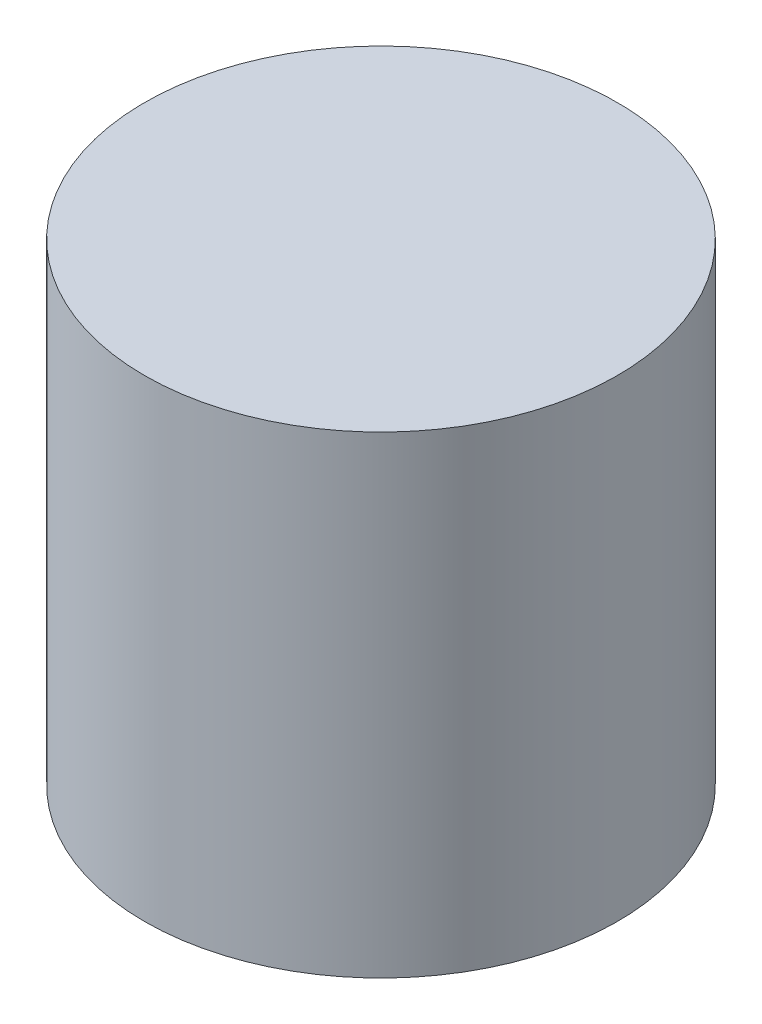
ISO-10303-21;
HEADER;
FILE_DESCRIPTION(('STEP AP214'),'2;1');
FILE_NAME('part.step','',(''),(''),'','','');
FILE_SCHEMA(('AUTOMOTIVE_DESIGN { 1 0 10303 214 1 1 1 1 }'));
ENDSEC;
DATA;
#1=APPLICATION_CONTEXT('core data for automotive mechanical design processes');
#2=APPLICATION_PROTOCOL_DEFINITION('international standard','automotive_design',2000,#1);
#3=PRODUCT_CONTEXT('',#1,'mechanical');
#4=PRODUCT('Part','Part','',(#3));
#5=PRODUCT_RELATED_PRODUCT_CATEGORY('part','',(#4));
#6=PRODUCT_DEFINITION_FORMATION('','',#4);
#7=PRODUCT_DEFINITION_CONTEXT('part definition',#1,'design');
#8=PRODUCT_DEFINITION('design','',#6,#7);
#9=PRODUCT_DEFINITION_SHAPE('','',#8);
#10=(LENGTH_UNIT() NAMED_UNIT(*) SI_UNIT(.MILLI.,.METRE.));
#11=(NAMED_UNIT(*) PLANE_ANGLE_UNIT() SI_UNIT($,.RADIAN.));
#12=(NAMED_UNIT(*) SI_UNIT($,.STERADIAN.) SOLID_ANGLE_UNIT());
#13=UNCERTAINTY_MEASURE_WITH_UNIT(LENGTH_MEASURE(1.E-05),#10,'distance_accuracy_value','');
#14=(GEOMETRIC_REPRESENTATION_CONTEXT(3) GLOBAL_UNCERTAINTY_ASSIGNED_CONTEXT((#13)) GLOBAL_UNIT_ASSIGNED_CONTEXT((#10,
#11,#12)) REPRESENTATION_CONTEXT('',''));
#15=CARTESIAN_POINT('',(0.,0.,0.));
#16=DIRECTION('',(0.,0.,1.));
#17=DIRECTION('',(1.,0.,0.));
#18=AXIS2_PLACEMENT_3D('',#15,#16,#17);
#19=CARTESIAN_POINT('',(0.,6.35,0.));
#20=DIRECTION('',(0.,-1.,0.));
#21=DIRECTION('',(0.,0.,-1.));
#22=AXIS2_PLACEMENT_3D('',#19,#20,#21);
#23=CYLINDRICAL_SURFACE('',#22,3.175);
#24=CARTESIAN_POINT('',(0.,6.35,0.));
#25=DIRECTION('',(0.,1.,0.));
#26=DIRECTION('',(0.,0.,1.));
#27=AXIS2_PLACEMENT_3D('',#24,#25,#26);
#28=CIRCLE('',#27,3.175);
#29=CARTESIAN_POINT('',(0.,6.35,3.175));
#30=VERTEX_POINT('',#29);
#31=EDGE_CURVE('E10',#30,#30,#28,.T.);
#32=ORIENTED_EDGE('',*,*,#31,.F.);
#33=EDGE_LOOP('',(#32));
#34=FACE_BOUND('',#33,.T.);
#35=CARTESIAN_POINT('',(0.,0.,0.));
#36=DIRECTION('',(0.,1.,0.));
#37=DIRECTION('',(0.,0.,1.));
#38=AXIS2_PLACEMENT_3D('',#35,#36,#37);
#39=CIRCLE('',#38,3.175);
#40=CARTESIAN_POINT('',(0.,0.,3.175));
#41=VERTEX_POINT('',#40);
#42=EDGE_CURVE('E34',#41,#41,#39,.T.);
#43=ORIENTED_EDGE('',*,*,#42,.T.);
#44=EDGE_LOOP('',(#43));
#45=FACE_BOUND('',#44,.T.);
#46=ADVANCED_FACE('F31',(#34,#45),#23,.T.);
#47=CARTESIAN_POINT('',(0.,6.35,0.));
#48=DIRECTION('',(0.,1.,0.));
#49=DIRECTION('',(0.,0.,1.));
#50=AXIS2_PLACEMENT_3D('',#47,#48,#49);
#51=PLANE('',#50);
#52=ORIENTED_EDGE('',*,*,#31,.T.);
#53=EDGE_LOOP('',(#52));
#54=FACE_BOUND('',#53,.T.);
#55=ADVANCED_FACE('F46',(#54),#51,.T.);
#56=CARTESIAN_POINT('',(0.,0.,0.));
#57=DIRECTION('',(0.,1.,0.));
#58=DIRECTION('',(0.,0.,1.));
#59=AXIS2_PLACEMENT_3D('',#56,#57,#58);
#60=PLANE('',#59);
#61=ORIENTED_EDGE('',*,*,#42,.F.);
#62=EDGE_LOOP('',(#61));
#63=FACE_BOUND('',#62,.T.);
#64=ADVANCED_FACE('F44',(#63),#60,.F.);
#65=CLOSED_SHELL('',(#46,#55,#64));
#66=MANIFOLD_SOLID_BREP('B2',#65);
#67=ADVANCED_BREP_SHAPE_REPRESENTATION('',(#18,#66),#14);
#68=SHAPE_DEFINITION_REPRESENTATION(#9,#67);
ENDSEC;
END-ISO-10303-21;
